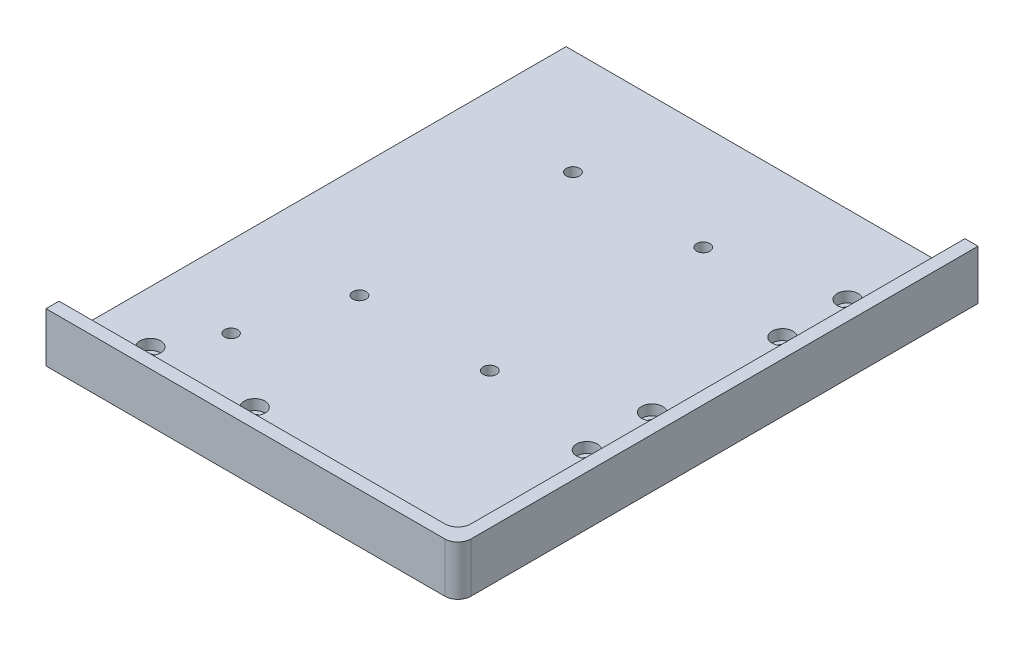
ISO-10303-21;
HEADER;
FILE_DESCRIPTION(('STEP AP214'),'2;1');
FILE_NAME('part.step','',(''),(''),'','','');
FILE_SCHEMA(('AUTOMOTIVE_DESIGN { 1 0 10303 214 1 1 1 1 }'));
ENDSEC;
DATA;
#1=APPLICATION_CONTEXT('core data for automotive mechanical design processes');
#2=APPLICATION_PROTOCOL_DEFINITION('international standard','automotive_design',2000,#1);
#3=PRODUCT_CONTEXT('',#1,'mechanical');
#4=PRODUCT('Part','Part','',(#3));
#5=PRODUCT_RELATED_PRODUCT_CATEGORY('part','',(#4));
#6=PRODUCT_DEFINITION_FORMATION('','',#4);
#7=PRODUCT_DEFINITION_CONTEXT('part definition',#1,'design');
#8=PRODUCT_DEFINITION('design','',#6,#7);
#9=PRODUCT_DEFINITION_SHAPE('','',#8);
#10=(LENGTH_UNIT() NAMED_UNIT(*) SI_UNIT(.MILLI.,.METRE.));
#11=(NAMED_UNIT(*) PLANE_ANGLE_UNIT() SI_UNIT($,.RADIAN.));
#12=(NAMED_UNIT(*) SI_UNIT($,.STERADIAN.) SOLID_ANGLE_UNIT());
#13=UNCERTAINTY_MEASURE_WITH_UNIT(LENGTH_MEASURE(1.E-05),#10,'distance_accuracy_value','');
#14=(GEOMETRIC_REPRESENTATION_CONTEXT(3) GLOBAL_UNCERTAINTY_ASSIGNED_CONTEXT((#13)) GLOBAL_UNIT_ASSIGNED_CONTEXT((#10,
#11,#12)) REPRESENTATION_CONTEXT('',''));
#15=CARTESIAN_POINT('',(0.,0.,0.));
#16=DIRECTION('',(0.,0.,1.));
#17=DIRECTION('',(1.,0.,0.));
#18=AXIS2_PLACEMENT_3D('',#15,#16,#17);
#19=CARTESIAN_POINT('',(0.,6.35,0.));
#20=DIRECTION('',(1.,0.,0.));
#21=DIRECTION('',(0.,0.,-1.));
#22=AXIS2_PLACEMENT_3D('',#19,#20,#21);
#23=PLANE('',#22);
#24=DIRECTION('',(0.,0.,1.));
#25=VECTOR('',#24,1.);
#26=CARTESIAN_POINT('',(0.,0.,0.));
#27=LINE('',#26,#25);
#28=CARTESIAN_POINT('',(0.,0.,0.));
#29=VERTEX_POINT('',#28);
#30=CARTESIAN_POINT('',(0.,0.,199.5));
#31=VERTEX_POINT('',#30);
#32=EDGE_CURVE('E157',#29,#31,#27,.T.);
#33=ORIENTED_EDGE('',*,*,#32,.T.);
#34=DIRECTION('',(0.,-1.,0.));
#35=VECTOR('',#34,1.);
#36=CARTESIAN_POINT('',(0.,6.35,199.5));
#37=LINE('',#36,#35);
#38=CARTESIAN_POINT('',(0.,19.05,199.5));
#39=VERTEX_POINT('',#38);
#40=EDGE_CURVE('E131',#39,#31,#37,.T.);
#41=ORIENTED_EDGE('',*,*,#40,.F.);
#42=DIRECTION('',(0.,0.,1.));
#43=VECTOR('',#42,1.);
#44=CARTESIAN_POINT('',(0.,19.05,199.5));
#45=LINE('',#44,#43);
#46=CARTESIAN_POINT('',(0.,19.05,194.5));
#47=VERTEX_POINT('',#46);
#48=EDGE_CURVE('E145',#47,#39,#45,.T.);
#49=ORIENTED_EDGE('',*,*,#48,.F.);
#50=DIRECTION('',(0.,-1.,0.));
#51=VECTOR('',#50,1.);
#52=CARTESIAN_POINT('',(0.,19.05,194.5));
#53=LINE('',#52,#51);
#54=CARTESIAN_POINT('',(0.,6.35,194.5));
#55=VERTEX_POINT('',#54);
#56=EDGE_CURVE('E148',#47,#55,#53,.T.);
#57=ORIENTED_EDGE('',*,*,#56,.T.);
#58=DIRECTION('',(0.,0.,1.));
#59=VECTOR('',#58,1.);
#60=CARTESIAN_POINT('',(0.,6.35,0.));
#61=LINE('',#60,#59);
#62=CARTESIAN_POINT('',(0.,6.35,0.));
#63=VERTEX_POINT('',#62);
#64=EDGE_CURVE('E158',#63,#55,#61,.T.);
#65=ORIENTED_EDGE('',*,*,#64,.F.);
#66=DIRECTION('',(0.,-1.,0.));
#67=VECTOR('',#66,1.);
#68=CARTESIAN_POINT('',(0.,6.35,0.));
#69=LINE('',#68,#67);
#70=EDGE_CURVE('E132',#63,#29,#69,.T.);
#71=ORIENTED_EDGE('',*,*,#70,.T.);
#72=EDGE_LOOP('',(#33,#41,#49,#57,#65,#71));
#73=FACE_BOUND('',#72,.T.);
#74=ADVANCED_FACE('F41',(#73),#23,.F.);
#75=CARTESIAN_POINT('',(0.,6.35,199.5));
#76=DIRECTION('',(0.,0.,-1.));
#77=DIRECTION('',(-1.,0.,0.));
#78=AXIS2_PLACEMENT_3D('',#75,#76,#77);
#79=PLANE('',#78);
#80=DIRECTION('',(1.,0.,0.));
#81=VECTOR('',#80,1.);
#82=CARTESIAN_POINT('',(0.,0.,199.5));
#83=LINE('',#82,#81);
#84=CARTESIAN_POINT('',(153.,0.,199.5));
#85=VERTEX_POINT('',#84);
#86=EDGE_CURVE('E166',#31,#85,#83,.T.);
#87=ORIENTED_EDGE('',*,*,#86,.T.);
#88=DIRECTION('',(0.,-1.,0.));
#89=VECTOR('',#88,1.);
#90=CARTESIAN_POINT('',(153.,6.35,199.5));
#91=LINE('',#90,#89);
#92=CARTESIAN_POINT('',(153.,19.05,199.5));
#93=VERTEX_POINT('',#92);
#94=EDGE_CURVE('E179',#85,#93,#91,.F.);
#95=ORIENTED_EDGE('',*,*,#94,.T.);
#96=DIRECTION('',(1.,0.,0.));
#97=VECTOR('',#96,1.);
#98=CARTESIAN_POINT('',(0.,19.05,199.5));
#99=LINE('',#98,#97);
#100=EDGE_CURVE('E122',#39,#93,#99,.T.);
#101=ORIENTED_EDGE('',*,*,#100,.F.);
#102=ORIENTED_EDGE('',*,*,#40,.T.);
#103=EDGE_LOOP('',(#87,#95,#101,#102));
#104=FACE_BOUND('',#103,.T.);
#105=ADVANCED_FACE('F199',(#104),#79,.F.);
#106=CARTESIAN_POINT('',(158.,6.35,0.));
#107=DIRECTION('',(-1.,0.,0.));
#108=DIRECTION('',(0.,0.,1.));
#109=AXIS2_PLACEMENT_3D('',#106,#107,#108);
#110=PLANE('',#109);
#111=DIRECTION('',(0.,0.,-1.));
#112=VECTOR('',#111,1.);
#113=CARTESIAN_POINT('',(158.,19.05,199.5));
#114=LINE('',#113,#112);
#115=CARTESIAN_POINT('',(158.,19.05,194.5));
#116=VERTEX_POINT('',#115);
#117=CARTESIAN_POINT('',(158.,19.05,0.));
#118=VERTEX_POINT('',#117);
#119=EDGE_CURVE('E110',#116,#118,#114,.T.);
#120=ORIENTED_EDGE('',*,*,#119,.F.);
#121=DIRECTION('',(0.,-1.,0.));
#122=VECTOR('',#121,1.);
#123=CARTESIAN_POINT('',(158.,6.35,194.5));
#124=LINE('',#123,#122);
#125=CARTESIAN_POINT('',(158.,0.,194.5));
#126=VERTEX_POINT('',#125);
#127=EDGE_CURVE('E175',#116,#126,#124,.T.);
#128=ORIENTED_EDGE('',*,*,#127,.T.);
#129=DIRECTION('',(0.,0.,-1.));
#130=VECTOR('',#129,1.);
#131=CARTESIAN_POINT('',(158.,0.,0.));
#132=LINE('',#131,#130);
#133=CARTESIAN_POINT('',(158.,0.,0.));
#134=VERTEX_POINT('',#133);
#135=EDGE_CURVE('E128',#126,#134,#132,.T.);
#136=ORIENTED_EDGE('',*,*,#135,.T.);
#137=DIRECTION('',(0.,-1.,0.));
#138=VECTOR('',#137,1.);
#139=CARTESIAN_POINT('',(158.,6.35,0.));
#140=LINE('',#139,#138);
#141=EDGE_CURVE('E125',#118,#134,#140,.T.);
#142=ORIENTED_EDGE('',*,*,#141,.F.);
#143=EDGE_LOOP('',(#120,#128,#136,#142));
#144=FACE_BOUND('',#143,.T.);
#145=ADVANCED_FACE('F126',(#144),#110,.F.);
#146=CARTESIAN_POINT('',(0.,6.35,0.));
#147=DIRECTION('',(0.,0.,1.));
#148=DIRECTION('',(1.,0.,0.));
#149=AXIS2_PLACEMENT_3D('',#146,#147,#148);
#150=PLANE('',#149);
#151=DIRECTION('',(-1.,0.,0.));
#152=VECTOR('',#151,1.);
#153=CARTESIAN_POINT('',(0.,0.,0.));
#154=LINE('',#153,#152);
#155=EDGE_CURVE('E162',#134,#29,#154,.T.);
#156=ORIENTED_EDGE('',*,*,#155,.T.);
#157=ORIENTED_EDGE('',*,*,#70,.F.);
#158=DIRECTION('',(-1.,0.,0.));
#159=VECTOR('',#158,1.);
#160=CARTESIAN_POINT('',(0.,6.35,0.));
#161=LINE('',#160,#159);
#162=CARTESIAN_POINT('',(153.,6.35,0.));
#163=VERTEX_POINT('',#162);
#164=EDGE_CURVE('E161',#163,#63,#161,.T.);
#165=ORIENTED_EDGE('',*,*,#164,.F.);
#166=DIRECTION('',(0.,-1.,0.));
#167=VECTOR('',#166,1.);
#168=CARTESIAN_POINT('',(153.,19.05,0.));
#169=LINE('',#168,#167);
#170=CARTESIAN_POINT('',(153.,19.05,0.));
#171=VERTEX_POINT('',#170);
#172=EDGE_CURVE('E137',#171,#163,#169,.T.);
#173=ORIENTED_EDGE('',*,*,#172,.F.);
#174=DIRECTION('',(-1.,0.,0.));
#175=VECTOR('',#174,1.);
#176=CARTESIAN_POINT('',(158.,19.05,0.));
#177=LINE('',#176,#175);
#178=EDGE_CURVE('E115',#118,#171,#177,.T.);
#179=ORIENTED_EDGE('',*,*,#178,.F.);
#180=ORIENTED_EDGE('',*,*,#141,.T.);
#181=EDGE_LOOP('',(#156,#157,#165,#173,#179,#180));
#182=FACE_BOUND('',#181,.T.);
#183=ADVANCED_FACE('F134',(#182),#150,.F.);
#184=CARTESIAN_POINT('',(0.,6.35,0.));
#185=DIRECTION('',(0.,1.,0.));
#186=DIRECTION('',(0.,0.,1.));
#187=AXIS2_PLACEMENT_3D('',#184,#185,#186);
#188=PLANE('',#187);
#189=CARTESIAN_POINT('',(143.,6.35,159.5));
#190=DIRECTION('',(0.,1.,0.));
#191=DIRECTION('',(0.,0.,1.));
#192=AXIS2_PLACEMENT_3D('',#189,#190,#191);
#193=CIRCLE('',#192,2.5);
#194=CARTESIAN_POINT('',(143.,6.35,162.));
#195=VERTEX_POINT('',#194);
#196=EDGE_CURVE('E306',#195,#195,#193,.T.);
#197=ORIENTED_EDGE('',*,*,#196,.F.);
#198=EDGE_LOOP('',(#197));
#199=FACE_BOUND('',#198,.T.);
#200=CARTESIAN_POINT('',(31.,6.35,159.5));
#201=DIRECTION('',(0.,1.,0.));
#202=DIRECTION('',(0.,0.,1.));
#203=AXIS2_PLACEMENT_3D('',#200,#201,#202);
#204=CIRCLE('',#203,2.5);
#205=CARTESIAN_POINT('',(31.,6.35,162.));
#206=VERTEX_POINT('',#205);
#207=EDGE_CURVE('E300',#206,#206,#204,.T.);
#208=ORIENTED_EDGE('',*,*,#207,.F.);
#209=EDGE_LOOP('',(#208));
#210=FACE_BOUND('',#209,.T.);
#211=CARTESIAN_POINT('',(43.,6.35,122.25));
#212=DIRECTION('',(0.,1.,0.));
#213=DIRECTION('',(0.,0.,1.));
#214=AXIS2_PLACEMENT_3D('',#211,#212,#213);
#215=CIRCLE('',#214,2.55);
#216=CARTESIAN_POINT('',(43.,6.35,124.8));
#217=VERTEX_POINT('',#216);
#218=EDGE_CURVE('E294',#217,#217,#215,.T.);
#219=ORIENTED_EDGE('',*,*,#218,.F.);
#220=EDGE_LOOP('',(#219));
#221=FACE_BOUND('',#220,.T.);
#222=CARTESIAN_POINT('',(93.,6.35,122.25));
#223=DIRECTION('',(0.,1.,0.));
#224=DIRECTION('',(0.,0.,1.));
#225=AXIS2_PLACEMENT_3D('',#222,#223,#224);
#226=CIRCLE('',#225,2.55);
#227=CARTESIAN_POINT('',(93.,6.35,124.8));
#228=VERTEX_POINT('',#227);
#229=EDGE_CURVE('E288',#228,#228,#226,.T.);
#230=ORIENTED_EDGE('',*,*,#229,.F.);
#231=EDGE_LOOP('',(#230));
#232=FACE_BOUND('',#231,.T.);
#233=CARTESIAN_POINT('',(93.,6.35,40.38));
#234=DIRECTION('',(0.,1.,0.));
#235=DIRECTION('',(0.,0.,1.));
#236=AXIS2_PLACEMENT_3D('',#233,#234,#235);
#237=CIRCLE('',#236,2.55);
#238=CARTESIAN_POINT('',(93.,6.35,42.93));
#239=VERTEX_POINT('',#238);
#240=EDGE_CURVE('E282',#239,#239,#237,.T.);
#241=ORIENTED_EDGE('',*,*,#240,.F.);
#242=EDGE_LOOP('',(#241));
#243=FACE_BOUND('',#242,.T.);
#244=CARTESIAN_POINT('',(43.,6.35,40.38));
#245=DIRECTION('',(0.,1.,0.));
#246=DIRECTION('',(0.,0.,1.));
#247=AXIS2_PLACEMENT_3D('',#244,#245,#246);
#248=CIRCLE('',#247,2.55);
#249=CARTESIAN_POINT('',(43.,6.35,42.93));
#250=VERTEX_POINT('',#249);
#251=EDGE_CURVE('E276',#250,#250,#248,.T.);
#252=ORIENTED_EDGE('',*,*,#251,.F.);
#253=EDGE_LOOP('',(#252));
#254=FACE_BOUND('',#253,.T.);
#255=CARTESIAN_POINT('',(20.,6.35,179.5));
#256=DIRECTION('',(0.,1.,0.));
#257=DIRECTION('',(0.,0.,1.));
#258=AXIS2_PLACEMENT_3D('',#255,#256,#257);
#259=CIRCLE('',#258,4.);
#260=CARTESIAN_POINT('',(20.,6.35,183.5));
#261=VERTEX_POINT('',#260);
#262=EDGE_CURVE('E270',#261,#261,#259,.T.);
#263=ORIENTED_EDGE('',*,*,#262,.F.);
#264=EDGE_LOOP('',(#263));
#265=FACE_BOUND('',#264,.T.);
#266=CARTESIAN_POINT('',(60.,6.35,179.5));
#267=DIRECTION('',(0.,1.,0.));
#268=DIRECTION('',(0.,0.,1.));
#269=AXIS2_PLACEMENT_3D('',#266,#267,#268);
#270=CIRCLE('',#269,4.);
#271=CARTESIAN_POINT('',(60.,6.35,183.5));
#272=VERTEX_POINT('',#271);
#273=EDGE_CURVE('E258',#272,#272,#270,.T.);
#274=ORIENTED_EDGE('',*,*,#273,.F.);
#275=EDGE_LOOP('',(#274));
#276=FACE_BOUND('',#275,.T.);
#277=CARTESIAN_POINT('',(138.,6.35,130.));
#278=DIRECTION('',(0.,1.,0.));
#279=DIRECTION('',(0.,0.,1.));
#280=AXIS2_PLACEMENT_3D('',#277,#278,#279);
#281=CIRCLE('',#280,4.);
#282=CARTESIAN_POINT('',(138.,6.35,134.));
#283=VERTEX_POINT('',#282);
#284=EDGE_CURVE('E246',#283,#283,#281,.T.);
#285=ORIENTED_EDGE('',*,*,#284,.F.);
#286=EDGE_LOOP('',(#285));
#287=FACE_BOUND('',#286,.T.);
#288=CARTESIAN_POINT('',(138.,6.35,105.));
#289=DIRECTION('',(0.,1.,0.));
#290=DIRECTION('',(0.,0.,1.));
#291=AXIS2_PLACEMENT_3D('',#288,#289,#290);
#292=CIRCLE('',#291,4.);
#293=CARTESIAN_POINT('',(138.,6.35,109.));
#294=VERTEX_POINT('',#293);
#295=EDGE_CURVE('E234',#294,#294,#292,.T.);
#296=ORIENTED_EDGE('',*,*,#295,.F.);
#297=EDGE_LOOP('',(#296));
#298=FACE_BOUND('',#297,.T.);
#299=CARTESIAN_POINT('',(138.,6.35,30.));
#300=DIRECTION('',(0.,1.,0.));
#301=DIRECTION('',(0.,0.,1.));
#302=AXIS2_PLACEMENT_3D('',#299,#300,#301);
#303=CIRCLE('',#302,4.);
#304=CARTESIAN_POINT('',(138.,6.35,34.));
#305=VERTEX_POINT('',#304);
#306=EDGE_CURVE('E222',#305,#305,#303,.T.);
#307=ORIENTED_EDGE('',*,*,#306,.F.);
#308=EDGE_LOOP('',(#307));
#309=FACE_BOUND('',#308,.T.);
#310=CARTESIAN_POINT('',(138.,6.35,55.));
#311=DIRECTION('',(0.,1.,0.));
#312=DIRECTION('',(0.,0.,1.));
#313=AXIS2_PLACEMENT_3D('',#310,#311,#312);
#314=CIRCLE('',#313,4.);
#315=CARTESIAN_POINT('',(138.,6.35,59.));
#316=VERTEX_POINT('',#315);
#317=EDGE_CURVE('E210',#316,#316,#314,.T.);
#318=ORIENTED_EDGE('',*,*,#317,.F.);
#319=EDGE_LOOP('',(#318));
#320=FACE_BOUND('',#319,.T.);
#321=DIRECTION('',(-1.,0.,0.));
#322=VECTOR('',#321,1.);
#323=CARTESIAN_POINT('',(0.,6.35,194.5));
#324=LINE('',#323,#322);
#325=CARTESIAN_POINT('',(148.,6.35,194.5));
#326=VERTEX_POINT('',#325);
#327=EDGE_CURVE('E151',#326,#55,#324,.T.);
#328=ORIENTED_EDGE('',*,*,#327,.F.);
#329=CARTESIAN_POINT('',(148.,6.35,189.5));
#330=DIRECTION('',(0.,1.,0.));
#331=DIRECTION('',(0.,0.,1.));
#332=AXIS2_PLACEMENT_3D('',#329,#330,#331);
#333=CIRCLE('',#332,5.);
#334=CARTESIAN_POINT('',(153.,6.35,189.5));
#335=VERTEX_POINT('',#334);
#336=EDGE_CURVE('E63',#326,#335,#333,.T.);
#337=ORIENTED_EDGE('',*,*,#336,.T.);
#338=DIRECTION('',(0.,0.,1.));
#339=VECTOR('',#338,1.);
#340=CARTESIAN_POINT('',(153.,6.35,194.5));
#341=LINE('',#340,#339);
#342=EDGE_CURVE('E149',#163,#335,#341,.T.);
#343=ORIENTED_EDGE('',*,*,#342,.F.);
#344=ORIENTED_EDGE('',*,*,#164,.T.);
#345=ORIENTED_EDGE('',*,*,#64,.T.);
#346=EDGE_LOOP('',(#328,#337,#343,#344,#345));
#347=FACE_BOUND('',#346,.T.);
#348=ADVANCED_FACE('F192',(#199,#210,#221,#232,#243,#254,#265,#276,#287,#298,#309,#320,#347),
#188,.T.);
#349=CARTESIAN_POINT('',(0.,0.,0.));
#350=DIRECTION('',(0.,1.,0.));
#351=DIRECTION('',(0.,0.,1.));
#352=AXIS2_PLACEMENT_3D('',#349,#350,#351);
#353=PLANE('',#352);
#354=CARTESIAN_POINT('',(143.,0.,159.5));
#355=DIRECTION('',(0.,1.,0.));
#356=DIRECTION('',(0.,0.,1.));
#357=AXIS2_PLACEMENT_3D('',#354,#355,#356);
#358=CIRCLE('',#357,2.5);
#359=CARTESIAN_POINT('',(143.,0.,162.));
#360=VERTEX_POINT('',#359);
#361=EDGE_CURVE('E303',#360,#360,#358,.T.);
#362=ORIENTED_EDGE('',*,*,#361,.T.);
#363=EDGE_LOOP('',(#362));
#364=FACE_BOUND('',#363,.T.);
#365=CARTESIAN_POINT('',(31.,0.,159.5));
#366=DIRECTION('',(0.,1.,0.));
#367=DIRECTION('',(0.,0.,1.));
#368=AXIS2_PLACEMENT_3D('',#365,#366,#367);
#369=CIRCLE('',#368,2.5);
#370=CARTESIAN_POINT('',(31.,0.,162.));
#371=VERTEX_POINT('',#370);
#372=EDGE_CURVE('E297',#371,#371,#369,.T.);
#373=ORIENTED_EDGE('',*,*,#372,.T.);
#374=EDGE_LOOP('',(#373));
#375=FACE_BOUND('',#374,.T.);
#376=CARTESIAN_POINT('',(43.,0.,122.25));
#377=DIRECTION('',(0.,1.,0.));
#378=DIRECTION('',(0.,0.,1.));
#379=AXIS2_PLACEMENT_3D('',#376,#377,#378);
#380=CIRCLE('',#379,2.55);
#381=CARTESIAN_POINT('',(43.,0.,124.8));
#382=VERTEX_POINT('',#381);
#383=EDGE_CURVE('E291',#382,#382,#380,.T.);
#384=ORIENTED_EDGE('',*,*,#383,.T.);
#385=EDGE_LOOP('',(#384));
#386=FACE_BOUND('',#385,.T.);
#387=CARTESIAN_POINT('',(93.,0.,122.25));
#388=DIRECTION('',(0.,1.,0.));
#389=DIRECTION('',(0.,0.,1.));
#390=AXIS2_PLACEMENT_3D('',#387,#388,#389);
#391=CIRCLE('',#390,2.55);
#392=CARTESIAN_POINT('',(93.,0.,124.8));
#393=VERTEX_POINT('',#392);
#394=EDGE_CURVE('E285',#393,#393,#391,.T.);
#395=ORIENTED_EDGE('',*,*,#394,.T.);
#396=EDGE_LOOP('',(#395));
#397=FACE_BOUND('',#396,.T.);
#398=CARTESIAN_POINT('',(93.,0.,40.38));
#399=DIRECTION('',(0.,1.,0.));
#400=DIRECTION('',(0.,0.,1.));
#401=AXIS2_PLACEMENT_3D('',#398,#399,#400);
#402=CIRCLE('',#401,2.55);
#403=CARTESIAN_POINT('',(93.,0.,42.93));
#404=VERTEX_POINT('',#403);
#405=EDGE_CURVE('E279',#404,#404,#402,.T.);
#406=ORIENTED_EDGE('',*,*,#405,.T.);
#407=EDGE_LOOP('',(#406));
#408=FACE_BOUND('',#407,.T.);
#409=CARTESIAN_POINT('',(43.,0.,40.38));
#410=DIRECTION('',(0.,1.,0.));
#411=DIRECTION('',(0.,0.,1.));
#412=AXIS2_PLACEMENT_3D('',#409,#410,#411);
#413=CIRCLE('',#412,2.55);
#414=CARTESIAN_POINT('',(43.,0.,42.93));
#415=VERTEX_POINT('',#414);
#416=EDGE_CURVE('E273',#415,#415,#413,.T.);
#417=ORIENTED_EDGE('',*,*,#416,.T.);
#418=EDGE_LOOP('',(#417));
#419=FACE_BOUND('',#418,.T.);
#420=CARTESIAN_POINT('',(20.,0.,179.5));
#421=DIRECTION('',(0.,1.,0.));
#422=DIRECTION('',(0.,0.,1.));
#423=AXIS2_PLACEMENT_3D('',#420,#421,#422);
#424=CIRCLE('',#423,2.25);
#425=CARTESIAN_POINT('',(20.,0.,181.75));
#426=VERTEX_POINT('',#425);
#427=EDGE_CURVE('E261',#426,#426,#424,.T.);
#428=ORIENTED_EDGE('',*,*,#427,.T.);
#429=EDGE_LOOP('',(#428));
#430=FACE_BOUND('',#429,.T.);
#431=CARTESIAN_POINT('',(60.,0.,179.5));
#432=DIRECTION('',(0.,1.,0.));
#433=DIRECTION('',(0.,0.,1.));
#434=AXIS2_PLACEMENT_3D('',#431,#432,#433);
#435=CIRCLE('',#434,2.25);
#436=CARTESIAN_POINT('',(60.,0.,181.75));
#437=VERTEX_POINT('',#436);
#438=EDGE_CURVE('E249',#437,#437,#435,.T.);
#439=ORIENTED_EDGE('',*,*,#438,.T.);
#440=EDGE_LOOP('',(#439));
#441=FACE_BOUND('',#440,.T.);
#442=CARTESIAN_POINT('',(138.,0.,130.));
#443=DIRECTION('',(0.,1.,0.));
#444=DIRECTION('',(0.,0.,1.));
#445=AXIS2_PLACEMENT_3D('',#442,#443,#444);
#446=CIRCLE('',#445,2.25);
#447=CARTESIAN_POINT('',(138.,0.,132.25));
#448=VERTEX_POINT('',#447);
#449=EDGE_CURVE('E237',#448,#448,#446,.T.);
#450=ORIENTED_EDGE('',*,*,#449,.T.);
#451=EDGE_LOOP('',(#450));
#452=FACE_BOUND('',#451,.T.);
#453=CARTESIAN_POINT('',(138.,0.,105.));
#454=DIRECTION('',(0.,1.,0.));
#455=DIRECTION('',(0.,0.,1.));
#456=AXIS2_PLACEMENT_3D('',#453,#454,#455);
#457=CIRCLE('',#456,2.25);
#458=CARTESIAN_POINT('',(138.,0.,107.25));
#459=VERTEX_POINT('',#458);
#460=EDGE_CURVE('E225',#459,#459,#457,.T.);
#461=ORIENTED_EDGE('',*,*,#460,.T.);
#462=EDGE_LOOP('',(#461));
#463=FACE_BOUND('',#462,.T.);
#464=CARTESIAN_POINT('',(138.,0.,30.));
#465=DIRECTION('',(0.,1.,0.));
#466=DIRECTION('',(0.,0.,1.));
#467=AXIS2_PLACEMENT_3D('',#464,#465,#466);
#468=CIRCLE('',#467,2.25);
#469=CARTESIAN_POINT('',(138.,0.,32.25));
#470=VERTEX_POINT('',#469);
#471=EDGE_CURVE('E213',#470,#470,#468,.T.);
#472=ORIENTED_EDGE('',*,*,#471,.T.);
#473=EDGE_LOOP('',(#472));
#474=FACE_BOUND('',#473,.T.);
#475=CARTESIAN_POINT('',(138.,0.,55.));
#476=DIRECTION('',(0.,1.,0.));
#477=DIRECTION('',(0.,0.,1.));
#478=AXIS2_PLACEMENT_3D('',#475,#476,#477);
#479=CIRCLE('',#478,2.25);
#480=CARTESIAN_POINT('',(138.,0.,57.25));
#481=VERTEX_POINT('',#480);
#482=EDGE_CURVE('E152',#481,#481,#479,.T.);
#483=ORIENTED_EDGE('',*,*,#482,.T.);
#484=EDGE_LOOP('',(#483));
#485=FACE_BOUND('',#484,.T.);
#486=ORIENTED_EDGE('',*,*,#135,.F.);
#487=CARTESIAN_POINT('',(153.,0.,194.5));
#488=DIRECTION('',(0.,1.,0.));
#489=DIRECTION('',(0.,0.,1.));
#490=AXIS2_PLACEMENT_3D('',#487,#488,#489);
#491=CIRCLE('',#490,5.);
#492=EDGE_CURVE('E177',#126,#85,#491,.F.);
#493=ORIENTED_EDGE('',*,*,#492,.T.);
#494=ORIENTED_EDGE('',*,*,#86,.F.);
#495=ORIENTED_EDGE('',*,*,#32,.F.);
#496=ORIENTED_EDGE('',*,*,#155,.F.);
#497=EDGE_LOOP('',(#486,#493,#494,#495,#496));
#498=FACE_BOUND('',#497,.T.);
#499=ADVANCED_FACE('F314',(#364,#375,#386,#397,#408,#419,#430,#441,#452,#463,#474,#485,#498),
#353,.F.);
#500=CARTESIAN_POINT('',(153.,19.05,194.5));
#501=DIRECTION('',(1.,0.,0.));
#502=DIRECTION('',(0.,0.,-1.));
#503=AXIS2_PLACEMENT_3D('',#500,#501,#502);
#504=PLANE('',#503);
#505=ORIENTED_EDGE('',*,*,#342,.T.);
#506=DIRECTION('',(0.,-1.,0.));
#507=VECTOR('',#506,1.);
#508=CARTESIAN_POINT('',(153.,19.05,189.5));
#509=LINE('',#508,#507);
#510=CARTESIAN_POINT('',(153.,19.05,189.5));
#511=VERTEX_POINT('',#510);
#512=EDGE_CURVE('E49',#335,#511,#509,.F.);
#513=ORIENTED_EDGE('',*,*,#512,.T.);
#514=DIRECTION('',(0.,0.,1.));
#515=VECTOR('',#514,1.);
#516=CARTESIAN_POINT('',(153.,19.05,194.5));
#517=LINE('',#516,#515);
#518=EDGE_CURVE('E138',#171,#511,#517,.T.);
#519=ORIENTED_EDGE('',*,*,#518,.F.);
#520=ORIENTED_EDGE('',*,*,#172,.T.);
#521=EDGE_LOOP('',(#505,#513,#519,#520));
#522=FACE_BOUND('',#521,.T.);
#523=ADVANCED_FACE('F379',(#522),#504,.F.);
#524=CARTESIAN_POINT('',(0.,19.05,194.5));
#525=DIRECTION('',(0.,0.,1.));
#526=DIRECTION('',(1.,0.,0.));
#527=AXIS2_PLACEMENT_3D('',#524,#525,#526);
#528=PLANE('',#527);
#529=DIRECTION('',(-1.,0.,0.));
#530=VECTOR('',#529,1.);
#531=CARTESIAN_POINT('',(0.,19.05,194.5));
#532=LINE('',#531,#530);
#533=CARTESIAN_POINT('',(148.,19.05,194.5));
#534=VERTEX_POINT('',#533);
#535=EDGE_CURVE('E140',#534,#47,#532,.T.);
#536=ORIENTED_EDGE('',*,*,#535,.F.);
#537=DIRECTION('',(0.,-1.,0.));
#538=VECTOR('',#537,1.);
#539=CARTESIAN_POINT('',(148.,6.35,194.5));
#540=LINE('',#539,#538);
#541=EDGE_CURVE('E182',#534,#326,#540,.T.);
#542=ORIENTED_EDGE('',*,*,#541,.T.);
#543=ORIENTED_EDGE('',*,*,#327,.T.);
#544=ORIENTED_EDGE('',*,*,#56,.F.);
#545=EDGE_LOOP('',(#536,#542,#543,#544));
#546=FACE_BOUND('',#545,.T.);
#547=ADVANCED_FACE('F188',(#546),#528,.F.);
#548=CARTESIAN_POINT('',(0.,19.05,0.));
#549=DIRECTION('',(0.,1.,0.));
#550=DIRECTION('',(0.,0.,1.));
#551=AXIS2_PLACEMENT_3D('',#548,#549,#550);
#552=PLANE('',#551);
#553=ORIENTED_EDGE('',*,*,#100,.T.);
#554=CARTESIAN_POINT('',(153.,19.05,194.5));
#555=DIRECTION('',(0.,1.,0.));
#556=DIRECTION('',(0.,0.,1.));
#557=AXIS2_PLACEMENT_3D('',#554,#555,#556);
#558=CIRCLE('',#557,5.);
#559=EDGE_CURVE('E118',#93,#116,#558,.T.);
#560=ORIENTED_EDGE('',*,*,#559,.T.);
#561=ORIENTED_EDGE('',*,*,#119,.T.);
#562=ORIENTED_EDGE('',*,*,#178,.T.);
#563=ORIENTED_EDGE('',*,*,#518,.T.);
#564=CARTESIAN_POINT('',(148.,19.05,189.5));
#565=DIRECTION('',(0.,1.,0.));
#566=DIRECTION('',(0.,0.,1.));
#567=AXIS2_PLACEMENT_3D('',#564,#565,#566);
#568=CIRCLE('',#567,5.);
#569=EDGE_CURVE('E11',#511,#534,#568,.F.);
#570=ORIENTED_EDGE('',*,*,#569,.T.);
#571=ORIENTED_EDGE('',*,*,#535,.T.);
#572=ORIENTED_EDGE('',*,*,#48,.T.);
#573=EDGE_LOOP('',(#553,#560,#561,#562,#563,#570,#571,#572));
#574=FACE_BOUND('',#573,.T.);
#575=ADVANCED_FACE('F113',(#574),#552,.T.);
#576=CARTESIAN_POINT('',(138.,6.35,55.));
#577=DIRECTION('',(0.,1.,0.));
#578=DIRECTION('',(0.,0.,1.));
#579=AXIS2_PLACEMENT_3D('',#576,#577,#578);
#580=CYLINDRICAL_SURFACE('',#579,2.25);
#581=ORIENTED_EDGE('',*,*,#482,.F.);
#582=EDGE_LOOP('',(#581));
#583=FACE_BOUND('',#582,.T.);
#584=CARTESIAN_POINT('',(138.,2.35,55.));
#585=DIRECTION('',(0.,1.,0.));
#586=DIRECTION('',(0.,0.,1.));
#587=AXIS2_PLACEMENT_3D('',#584,#585,#586);
#588=CIRCLE('',#587,2.25);
#589=CARTESIAN_POINT('',(138.,2.35,57.25));
#590=VERTEX_POINT('',#589);
#591=EDGE_CURVE('E204',#590,#590,#588,.T.);
#592=ORIENTED_EDGE('',*,*,#591,.T.);
#593=EDGE_LOOP('',(#592));
#594=FACE_BOUND('',#593,.T.);
#595=ADVANCED_FACE('F351',(#583,#594),#580,.F.);
#596=CARTESIAN_POINT('',(140.25,2.35,55.));
#597=DIRECTION('',(0.,-1.,0.));
#598=DIRECTION('',(0.,0.,-1.));
#599=AXIS2_PLACEMENT_3D('',#596,#597,#598);
#600=PLANE('',#599);
#601=ORIENTED_EDGE('',*,*,#591,.F.);
#602=EDGE_LOOP('',(#601));
#603=FACE_BOUND('',#602,.T.);
#604=CARTESIAN_POINT('',(138.,2.35,55.));
#605=DIRECTION('',(0.,1.,0.));
#606=DIRECTION('',(0.,0.,1.));
#607=AXIS2_PLACEMENT_3D('',#604,#605,#606);
#608=CIRCLE('',#607,4.);
#609=CARTESIAN_POINT('',(138.,2.35,59.));
#610=VERTEX_POINT('',#609);
#611=EDGE_CURVE('E207',#610,#610,#608,.T.);
#612=ORIENTED_EDGE('',*,*,#611,.T.);
#613=EDGE_LOOP('',(#612));
#614=FACE_BOUND('',#613,.T.);
#615=ADVANCED_FACE('F341',(#603,#614),#600,.F.);
#616=CARTESIAN_POINT('',(138.,6.35,55.));
#617=DIRECTION('',(0.,1.,0.));
#618=DIRECTION('',(0.,0.,1.));
#619=AXIS2_PLACEMENT_3D('',#616,#617,#618);
#620=CYLINDRICAL_SURFACE('',#619,4.);
#621=ORIENTED_EDGE('',*,*,#611,.F.);
#622=EDGE_LOOP('',(#621));
#623=FACE_BOUND('',#622,.T.);
#624=ORIENTED_EDGE('',*,*,#317,.T.);
#625=EDGE_LOOP('',(#624));
#626=FACE_BOUND('',#625,.T.);
#627=ADVANCED_FACE('F338',(#623,#626),#620,.F.);
#628=CARTESIAN_POINT('',(138.,6.35,30.));
#629=DIRECTION('',(0.,1.,0.));
#630=DIRECTION('',(0.,0.,1.));
#631=AXIS2_PLACEMENT_3D('',#628,#629,#630);
#632=CYLINDRICAL_SURFACE('',#631,2.25);
#633=ORIENTED_EDGE('',*,*,#471,.F.);
#634=EDGE_LOOP('',(#633));
#635=FACE_BOUND('',#634,.T.);
#636=CARTESIAN_POINT('',(138.,2.35,30.));
#637=DIRECTION('',(0.,1.,0.));
#638=DIRECTION('',(0.,0.,1.));
#639=AXIS2_PLACEMENT_3D('',#636,#637,#638);
#640=CIRCLE('',#639,2.25);
#641=CARTESIAN_POINT('',(138.,2.35,32.25));
#642=VERTEX_POINT('',#641);
#643=EDGE_CURVE('E216',#642,#642,#640,.T.);
#644=ORIENTED_EDGE('',*,*,#643,.T.);
#645=EDGE_LOOP('',(#644));
#646=FACE_BOUND('',#645,.T.);
#647=ADVANCED_FACE('F340',(#635,#646),#632,.F.);
#648=CARTESIAN_POINT('',(140.25,2.35,30.));
#649=DIRECTION('',(0.,-1.,0.));
#650=DIRECTION('',(0.,0.,-1.));
#651=AXIS2_PLACEMENT_3D('',#648,#649,#650);
#652=PLANE('',#651);
#653=ORIENTED_EDGE('',*,*,#643,.F.);
#654=EDGE_LOOP('',(#653));
#655=FACE_BOUND('',#654,.T.);
#656=CARTESIAN_POINT('',(138.,2.35,30.));
#657=DIRECTION('',(0.,1.,0.));
#658=DIRECTION('',(0.,0.,1.));
#659=AXIS2_PLACEMENT_3D('',#656,#657,#658);
#660=CIRCLE('',#659,4.);
#661=CARTESIAN_POINT('',(138.,2.35,34.));
#662=VERTEX_POINT('',#661);
#663=EDGE_CURVE('E219',#662,#662,#660,.T.);
#664=ORIENTED_EDGE('',*,*,#663,.T.);
#665=EDGE_LOOP('',(#664));
#666=FACE_BOUND('',#665,.T.);
#667=ADVANCED_FACE('F348',(#655,#666),#652,.F.);
#668=CARTESIAN_POINT('',(138.,6.35,30.));
#669=DIRECTION('',(0.,1.,0.));
#670=DIRECTION('',(0.,0.,1.));
#671=AXIS2_PLACEMENT_3D('',#668,#669,#670);
#672=CYLINDRICAL_SURFACE('',#671,4.);
#673=ORIENTED_EDGE('',*,*,#663,.F.);
#674=EDGE_LOOP('',(#673));
#675=FACE_BOUND('',#674,.T.);
#676=ORIENTED_EDGE('',*,*,#306,.T.);
#677=EDGE_LOOP('',(#676));
#678=FACE_BOUND('',#677,.T.);
#679=ADVANCED_FACE('F536',(#675,#678),#672,.F.);
#680=CARTESIAN_POINT('',(138.,6.35,105.));
#681=DIRECTION('',(0.,1.,0.));
#682=DIRECTION('',(0.,0.,1.));
#683=AXIS2_PLACEMENT_3D('',#680,#681,#682);
#684=CYLINDRICAL_SURFACE('',#683,2.25);
#685=ORIENTED_EDGE('',*,*,#460,.F.);
#686=EDGE_LOOP('',(#685));
#687=FACE_BOUND('',#686,.T.);
#688=CARTESIAN_POINT('',(138.,2.35,105.));
#689=DIRECTION('',(0.,1.,0.));
#690=DIRECTION('',(0.,0.,1.));
#691=AXIS2_PLACEMENT_3D('',#688,#689,#690);
#692=CIRCLE('',#691,2.25);
#693=CARTESIAN_POINT('',(138.,2.35,107.25));
#694=VERTEX_POINT('',#693);
#695=EDGE_CURVE('E228',#694,#694,#692,.T.);
#696=ORIENTED_EDGE('',*,*,#695,.T.);
#697=EDGE_LOOP('',(#696));
#698=FACE_BOUND('',#697,.T.);
#699=ADVANCED_FACE('F527',(#687,#698),#684,.F.);
#700=CARTESIAN_POINT('',(140.25,2.35,105.));
#701=DIRECTION('',(0.,-1.,0.));
#702=DIRECTION('',(0.,0.,-1.));
#703=AXIS2_PLACEMENT_3D('',#700,#701,#702);
#704=PLANE('',#703);
#705=ORIENTED_EDGE('',*,*,#695,.F.);
#706=EDGE_LOOP('',(#705));
#707=FACE_BOUND('',#706,.T.);
#708=CARTESIAN_POINT('',(138.,2.35,105.));
#709=DIRECTION('',(0.,1.,0.));
#710=DIRECTION('',(0.,0.,1.));
#711=AXIS2_PLACEMENT_3D('',#708,#709,#710);
#712=CIRCLE('',#711,4.);
#713=CARTESIAN_POINT('',(138.,2.35,109.));
#714=VERTEX_POINT('',#713);
#715=EDGE_CURVE('E231',#714,#714,#712,.T.);
#716=ORIENTED_EDGE('',*,*,#715,.T.);
#717=EDGE_LOOP('',(#716));
#718=FACE_BOUND('',#717,.T.);
#719=ADVANCED_FACE('F518',(#707,#718),#704,.F.);
#720=CARTESIAN_POINT('',(138.,6.35,105.));
#721=DIRECTION('',(0.,1.,0.));
#722=DIRECTION('',(0.,0.,1.));
#723=AXIS2_PLACEMENT_3D('',#720,#721,#722);
#724=CYLINDRICAL_SURFACE('',#723,4.);
#725=ORIENTED_EDGE('',*,*,#715,.F.);
#726=EDGE_LOOP('',(#725));
#727=FACE_BOUND('',#726,.T.);
#728=ORIENTED_EDGE('',*,*,#295,.T.);
#729=EDGE_LOOP('',(#728));
#730=FACE_BOUND('',#729,.T.);
#731=ADVANCED_FACE('F509',(#727,#730),#724,.F.);
#732=CARTESIAN_POINT('',(138.,6.35,130.));
#733=DIRECTION('',(0.,1.,0.));
#734=DIRECTION('',(0.,0.,1.));
#735=AXIS2_PLACEMENT_3D('',#732,#733,#734);
#736=CYLINDRICAL_SURFACE('',#735,2.25);
#737=ORIENTED_EDGE('',*,*,#449,.F.);
#738=EDGE_LOOP('',(#737));
#739=FACE_BOUND('',#738,.T.);
#740=CARTESIAN_POINT('',(138.,2.35,130.));
#741=DIRECTION('',(0.,1.,0.));
#742=DIRECTION('',(0.,0.,1.));
#743=AXIS2_PLACEMENT_3D('',#740,#741,#742);
#744=CIRCLE('',#743,2.25);
#745=CARTESIAN_POINT('',(138.,2.35,132.25));
#746=VERTEX_POINT('',#745);
#747=EDGE_CURVE('E240',#746,#746,#744,.T.);
#748=ORIENTED_EDGE('',*,*,#747,.T.);
#749=EDGE_LOOP('',(#748));
#750=FACE_BOUND('',#749,.T.);
#751=ADVANCED_FACE('F500',(#739,#750),#736,.F.);
#752=CARTESIAN_POINT('',(140.25,2.35,130.));
#753=DIRECTION('',(0.,-1.,0.));
#754=DIRECTION('',(0.,0.,-1.));
#755=AXIS2_PLACEMENT_3D('',#752,#753,#754);
#756=PLANE('',#755);
#757=ORIENTED_EDGE('',*,*,#747,.F.);
#758=EDGE_LOOP('',(#757));
#759=FACE_BOUND('',#758,.T.);
#760=CARTESIAN_POINT('',(138.,2.35,130.));
#761=DIRECTION('',(0.,1.,0.));
#762=DIRECTION('',(0.,0.,1.));
#763=AXIS2_PLACEMENT_3D('',#760,#761,#762);
#764=CIRCLE('',#763,4.);
#765=CARTESIAN_POINT('',(138.,2.35,134.));
#766=VERTEX_POINT('',#765);
#767=EDGE_CURVE('E243',#766,#766,#764,.T.);
#768=ORIENTED_EDGE('',*,*,#767,.T.);
#769=EDGE_LOOP('',(#768));
#770=FACE_BOUND('',#769,.T.);
#771=ADVANCED_FACE('F491',(#759,#770),#756,.F.);
#772=CARTESIAN_POINT('',(138.,6.35,130.));
#773=DIRECTION('',(0.,1.,0.));
#774=DIRECTION('',(0.,0.,1.));
#775=AXIS2_PLACEMENT_3D('',#772,#773,#774);
#776=CYLINDRICAL_SURFACE('',#775,4.);
#777=ORIENTED_EDGE('',*,*,#767,.F.);
#778=EDGE_LOOP('',(#777));
#779=FACE_BOUND('',#778,.T.);
#780=ORIENTED_EDGE('',*,*,#284,.T.);
#781=EDGE_LOOP('',(#780));
#782=FACE_BOUND('',#781,.T.);
#783=ADVANCED_FACE('F482',(#779,#782),#776,.F.);
#784=CARTESIAN_POINT('',(60.,6.35,179.5));
#785=DIRECTION('',(0.,1.,0.));
#786=DIRECTION('',(0.,0.,1.));
#787=AXIS2_PLACEMENT_3D('',#784,#785,#786);
#788=CYLINDRICAL_SURFACE('',#787,2.25);
#789=ORIENTED_EDGE('',*,*,#438,.F.);
#790=EDGE_LOOP('',(#789));
#791=FACE_BOUND('',#790,.T.);
#792=CARTESIAN_POINT('',(60.,2.35,179.5));
#793=DIRECTION('',(0.,1.,0.));
#794=DIRECTION('',(0.,0.,1.));
#795=AXIS2_PLACEMENT_3D('',#792,#793,#794);
#796=CIRCLE('',#795,2.25);
#797=CARTESIAN_POINT('',(60.,2.35,181.75));
#798=VERTEX_POINT('',#797);
#799=EDGE_CURVE('E252',#798,#798,#796,.T.);
#800=ORIENTED_EDGE('',*,*,#799,.T.);
#801=EDGE_LOOP('',(#800));
#802=FACE_BOUND('',#801,.T.);
#803=ADVANCED_FACE('F473',(#791,#802),#788,.F.);
#804=CARTESIAN_POINT('',(62.25,2.35,179.5));
#805=DIRECTION('',(0.,-1.,0.));
#806=DIRECTION('',(0.,0.,-1.));
#807=AXIS2_PLACEMENT_3D('',#804,#805,#806);
#808=PLANE('',#807);
#809=ORIENTED_EDGE('',*,*,#799,.F.);
#810=EDGE_LOOP('',(#809));
#811=FACE_BOUND('',#810,.T.);
#812=CARTESIAN_POINT('',(60.,2.35,179.5));
#813=DIRECTION('',(0.,1.,0.));
#814=DIRECTION('',(0.,0.,1.));
#815=AXIS2_PLACEMENT_3D('',#812,#813,#814);
#816=CIRCLE('',#815,4.);
#817=CARTESIAN_POINT('',(60.,2.35,183.5));
#818=VERTEX_POINT('',#817);
#819=EDGE_CURVE('E255',#818,#818,#816,.T.);
#820=ORIENTED_EDGE('',*,*,#819,.T.);
#821=EDGE_LOOP('',(#820));
#822=FACE_BOUND('',#821,.T.);
#823=ADVANCED_FACE('F464',(#811,#822),#808,.F.);
#824=CARTESIAN_POINT('',(60.,6.35,179.5));
#825=DIRECTION('',(0.,1.,0.));
#826=DIRECTION('',(0.,0.,1.));
#827=AXIS2_PLACEMENT_3D('',#824,#825,#826);
#828=CYLINDRICAL_SURFACE('',#827,4.);
#829=ORIENTED_EDGE('',*,*,#819,.F.);
#830=EDGE_LOOP('',(#829));
#831=FACE_BOUND('',#830,.T.);
#832=ORIENTED_EDGE('',*,*,#273,.T.);
#833=EDGE_LOOP('',(#832));
#834=FACE_BOUND('',#833,.T.);
#835=ADVANCED_FACE('F455',(#831,#834),#828,.F.);
#836=CARTESIAN_POINT('',(20.,6.35,179.5));
#837=DIRECTION('',(0.,1.,0.));
#838=DIRECTION('',(0.,0.,1.));
#839=AXIS2_PLACEMENT_3D('',#836,#837,#838);
#840=CYLINDRICAL_SURFACE('',#839,2.25);
#841=ORIENTED_EDGE('',*,*,#427,.F.);
#842=EDGE_LOOP('',(#841));
#843=FACE_BOUND('',#842,.T.);
#844=CARTESIAN_POINT('',(20.,2.35,179.5));
#845=DIRECTION('',(0.,1.,0.));
#846=DIRECTION('',(0.,0.,1.));
#847=AXIS2_PLACEMENT_3D('',#844,#845,#846);
#848=CIRCLE('',#847,2.25);
#849=CARTESIAN_POINT('',(20.,2.35,181.75));
#850=VERTEX_POINT('',#849);
#851=EDGE_CURVE('E264',#850,#850,#848,.T.);
#852=ORIENTED_EDGE('',*,*,#851,.T.);
#853=EDGE_LOOP('',(#852));
#854=FACE_BOUND('',#853,.T.);
#855=ADVANCED_FACE('F446',(#843,#854),#840,.F.);
#856=CARTESIAN_POINT('',(22.25,2.35,179.5));
#857=DIRECTION('',(0.,-1.,0.));
#858=DIRECTION('',(0.,0.,-1.));
#859=AXIS2_PLACEMENT_3D('',#856,#857,#858);
#860=PLANE('',#859);
#861=ORIENTED_EDGE('',*,*,#851,.F.);
#862=EDGE_LOOP('',(#861));
#863=FACE_BOUND('',#862,.T.);
#864=CARTESIAN_POINT('',(20.,2.35,179.5));
#865=DIRECTION('',(0.,1.,0.));
#866=DIRECTION('',(0.,0.,1.));
#867=AXIS2_PLACEMENT_3D('',#864,#865,#866);
#868=CIRCLE('',#867,4.);
#869=CARTESIAN_POINT('',(20.,2.35,183.5));
#870=VERTEX_POINT('',#869);
#871=EDGE_CURVE('E267',#870,#870,#868,.T.);
#872=ORIENTED_EDGE('',*,*,#871,.T.);
#873=EDGE_LOOP('',(#872));
#874=FACE_BOUND('',#873,.T.);
#875=ADVANCED_FACE('F437',(#863,#874),#860,.F.);
#876=CARTESIAN_POINT('',(20.,6.35,179.5));
#877=DIRECTION('',(0.,1.,0.));
#878=DIRECTION('',(0.,0.,1.));
#879=AXIS2_PLACEMENT_3D('',#876,#877,#878);
#880=CYLINDRICAL_SURFACE('',#879,4.);
#881=ORIENTED_EDGE('',*,*,#871,.F.);
#882=EDGE_LOOP('',(#881));
#883=FACE_BOUND('',#882,.T.);
#884=ORIENTED_EDGE('',*,*,#262,.T.);
#885=EDGE_LOOP('',(#884));
#886=FACE_BOUND('',#885,.T.);
#887=ADVANCED_FACE('F428',(#883,#886),#880,.F.);
#888=CARTESIAN_POINT('',(43.,6.35,40.38));
#889=DIRECTION('',(0.,1.,0.));
#890=DIRECTION('',(0.,0.,1.));
#891=AXIS2_PLACEMENT_3D('',#888,#889,#890);
#892=CYLINDRICAL_SURFACE('',#891,2.55);
#893=ORIENTED_EDGE('',*,*,#416,.F.);
#894=EDGE_LOOP('',(#893));
#895=FACE_BOUND('',#894,.T.);
#896=ORIENTED_EDGE('',*,*,#251,.T.);
#897=EDGE_LOOP('',(#896));
#898=FACE_BOUND('',#897,.T.);
#899=ADVANCED_FACE('F419',(#895,#898),#892,.F.);
#900=CARTESIAN_POINT('',(93.,6.35,40.38));
#901=DIRECTION('',(0.,1.,0.));
#902=DIRECTION('',(0.,0.,1.));
#903=AXIS2_PLACEMENT_3D('',#900,#901,#902);
#904=CYLINDRICAL_SURFACE('',#903,2.55);
#905=ORIENTED_EDGE('',*,*,#405,.F.);
#906=EDGE_LOOP('',(#905));
#907=FACE_BOUND('',#906,.T.);
#908=ORIENTED_EDGE('',*,*,#240,.T.);
#909=EDGE_LOOP('',(#908));
#910=FACE_BOUND('',#909,.T.);
#911=ADVANCED_FACE('F410',(#907,#910),#904,.F.);
#912=CARTESIAN_POINT('',(93.,6.35,122.25));
#913=DIRECTION('',(0.,1.,0.));
#914=DIRECTION('',(0.,0.,1.));
#915=AXIS2_PLACEMENT_3D('',#912,#913,#914);
#916=CYLINDRICAL_SURFACE('',#915,2.55);
#917=ORIENTED_EDGE('',*,*,#394,.F.);
#918=EDGE_LOOP('',(#917));
#919=FACE_BOUND('',#918,.T.);
#920=ORIENTED_EDGE('',*,*,#229,.T.);
#921=EDGE_LOOP('',(#920));
#922=FACE_BOUND('',#921,.T.);
#923=ADVANCED_FACE('F374',(#919,#922),#916,.F.);
#924=CARTESIAN_POINT('',(43.,6.35,122.25));
#925=DIRECTION('',(0.,1.,0.));
#926=DIRECTION('',(0.,0.,1.));
#927=AXIS2_PLACEMENT_3D('',#924,#925,#926);
#928=CYLINDRICAL_SURFACE('',#927,2.55);
#929=ORIENTED_EDGE('',*,*,#383,.F.);
#930=EDGE_LOOP('',(#929));
#931=FACE_BOUND('',#930,.T.);
#932=ORIENTED_EDGE('',*,*,#218,.T.);
#933=EDGE_LOOP('',(#932));
#934=FACE_BOUND('',#933,.T.);
#935=ADVANCED_FACE('F365',(#931,#934),#928,.F.);
#936=CARTESIAN_POINT('',(153.,6.35,194.5));
#937=DIRECTION('',(0.,-1.,0.));
#938=DIRECTION('',(0.,0.,-1.));
#939=AXIS2_PLACEMENT_3D('',#936,#937,#938);
#940=CYLINDRICAL_SURFACE('',#939,5.);
#941=ORIENTED_EDGE('',*,*,#559,.F.);
#942=ORIENTED_EDGE('',*,*,#94,.F.);
#943=ORIENTED_EDGE('',*,*,#492,.F.);
#944=ORIENTED_EDGE('',*,*,#127,.F.);
#945=EDGE_LOOP('',(#941,#942,#943,#944));
#946=FACE_BOUND('',#945,.T.);
#947=ADVANCED_FACE('F363',(#946),#940,.T.);
#948=CARTESIAN_POINT('',(148.,19.05,189.5));
#949=DIRECTION('',(0.,1.,0.));
#950=DIRECTION('',(0.,0.,1.));
#951=AXIS2_PLACEMENT_3D('',#948,#949,#950);
#952=CYLINDRICAL_SURFACE('',#951,5.);
#953=ORIENTED_EDGE('',*,*,#569,.F.);
#954=ORIENTED_EDGE('',*,*,#512,.F.);
#955=ORIENTED_EDGE('',*,*,#336,.F.);
#956=ORIENTED_EDGE('',*,*,#541,.F.);
#957=EDGE_LOOP('',(#953,#954,#955,#956));
#958=FACE_BOUND('',#957,.T.);
#959=ADVANCED_FACE('F43',(#958),#952,.F.);
#960=CARTESIAN_POINT('',(31.,6.35,159.5));
#961=DIRECTION('',(0.,1.,0.));
#962=DIRECTION('',(0.,0.,1.));
#963=AXIS2_PLACEMENT_3D('',#960,#961,#962);
#964=CYLINDRICAL_SURFACE('',#963,2.5);
#965=ORIENTED_EDGE('',*,*,#372,.F.);
#966=EDGE_LOOP('',(#965));
#967=FACE_BOUND('',#966,.T.);
#968=ORIENTED_EDGE('',*,*,#207,.T.);
#969=EDGE_LOOP('',(#968));
#970=FACE_BOUND('',#969,.T.);
#971=ADVANCED_FACE('F372',(#967,#970),#964,.F.);
#972=CARTESIAN_POINT('',(143.,6.35,159.5));
#973=DIRECTION('',(0.,1.,0.));
#974=DIRECTION('',(0.,0.,1.));
#975=AXIS2_PLACEMENT_3D('',#972,#973,#974);
#976=CYLINDRICAL_SURFACE('',#975,2.5);
#977=ORIENTED_EDGE('',*,*,#361,.F.);
#978=EDGE_LOOP('',(#977));
#979=FACE_BOUND('',#978,.T.);
#980=ORIENTED_EDGE('',*,*,#196,.T.);
#981=EDGE_LOOP('',(#980));
#982=FACE_BOUND('',#981,.T.);
#983=ADVANCED_FACE('F310',(#979,#982),#976,.F.);
#984=CLOSED_SHELL('',(#74,#105,#145,#183,#348,#499,#523,#547,#575,#595,#615,#627,#647,#667,#679,
#699,#719,#731,#751,#771,#783,#803,#823,#835,#855,#875,#887,#899,#911,#923,#935,#947,#959,#971,#983));
#985=MANIFOLD_SOLID_BREP('B2',#984);
#986=ADVANCED_BREP_SHAPE_REPRESENTATION('',(#18,#985),#14);
#987=SHAPE_DEFINITION_REPRESENTATION(#9,#986);
ENDSEC;
END-ISO-10303-21;
